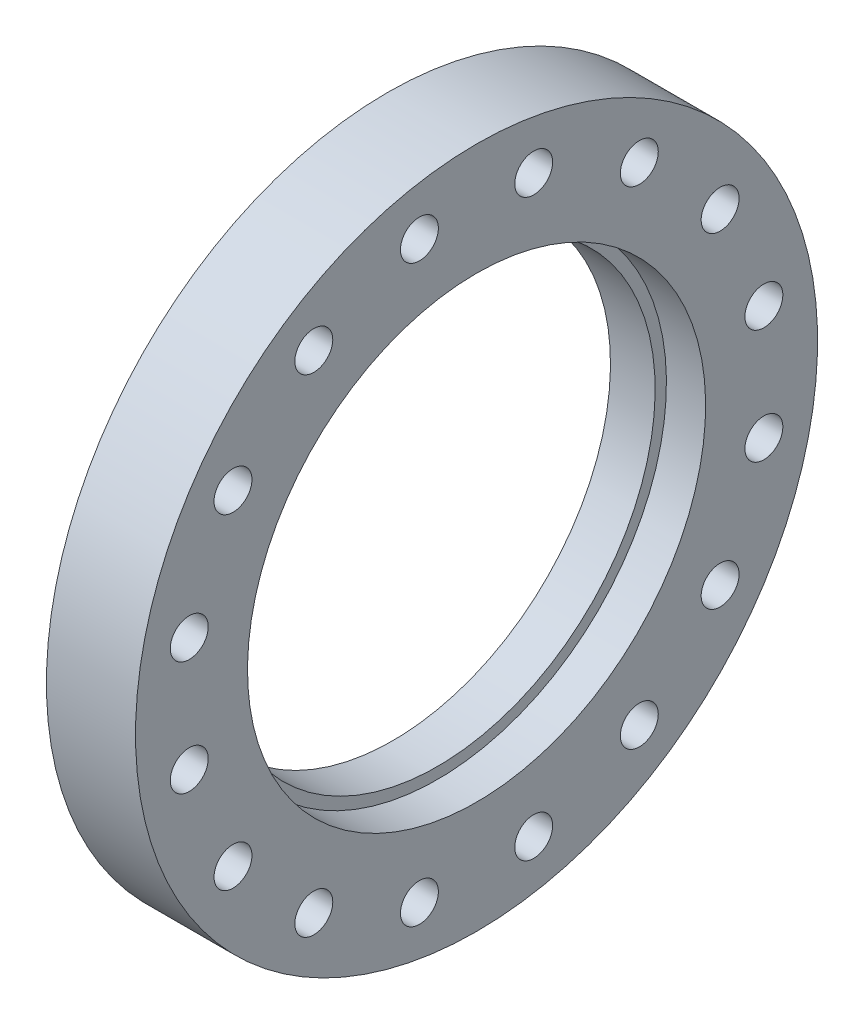
ISO-10303-21;
HEADER;
FILE_DESCRIPTION(('STEP AP214'),'2;1');
FILE_NAME('part.step','',(''),(''),'','','');
FILE_SCHEMA(('AUTOMOTIVE_DESIGN { 1 0 10303 214 1 1 1 1 }'));
ENDSEC;
DATA;
#1=APPLICATION_CONTEXT('core data for automotive mechanical design processes');
#2=APPLICATION_PROTOCOL_DEFINITION('international standard','automotive_design',2000,#1);
#3=PRODUCT_CONTEXT('',#1,'mechanical');
#4=PRODUCT('Part','Part','',(#3));
#5=PRODUCT_RELATED_PRODUCT_CATEGORY('part','',(#4));
#6=PRODUCT_DEFINITION_FORMATION('','',#4);
#7=PRODUCT_DEFINITION_CONTEXT('part definition',#1,'design');
#8=PRODUCT_DEFINITION('design','',#6,#7);
#9=PRODUCT_DEFINITION_SHAPE('','',#8);
#10=(LENGTH_UNIT() NAMED_UNIT(*) SI_UNIT(.MILLI.,.METRE.));
#11=(NAMED_UNIT(*) PLANE_ANGLE_UNIT() SI_UNIT($,.RADIAN.));
#12=(NAMED_UNIT(*) SI_UNIT($,.STERADIAN.) SOLID_ANGLE_UNIT());
#13=UNCERTAINTY_MEASURE_WITH_UNIT(LENGTH_MEASURE(1.E-05),#10,'distance_accuracy_value','');
#14=(GEOMETRIC_REPRESENTATION_CONTEXT(3) GLOBAL_UNCERTAINTY_ASSIGNED_CONTEXT((#13)) GLOBAL_UNIT_ASSIGNED_CONTEXT((#10,
#11,#12)) REPRESENTATION_CONTEXT('',''));
#15=CARTESIAN_POINT('',(0.,0.,0.));
#16=DIRECTION('',(0.,0.,1.));
#17=DIRECTION('',(1.,0.,0.));
#18=AXIS2_PLACEMENT_3D('',#15,#16,#17);
#19=CARTESIAN_POINT('',(1.17000000000035,53.038375,0.));
#20=DIRECTION('',(-1.,0.,0.));
#21=DIRECTION('',(0.,0.,1.));
#22=AXIS2_PLACEMENT_3D('',#19,#20,#21);
#23=PLANE('',#22);
#24=CARTESIAN_POINT('',(1.17000000000036,0.,0.));
#25=DIRECTION('',(1.,0.,0.));
#26=DIRECTION('',(0.,1.,0.));
#27=AXIS2_PLACEMENT_3D('',#24,#25,#26);
#28=CIRCLE('',#27,48.41875);
#29=CARTESIAN_POINT('',(1.17000000000035,48.41875,0.));
#30=VERTEX_POINT('',#29);
#31=EDGE_CURVE('E18',#30,#30,#28,.T.);
#32=ORIENTED_EDGE('',*,*,#31,.T.);
#33=EDGE_LOOP('',(#32));
#34=FACE_BOUND('',#33,.T.);
#35=CARTESIAN_POINT('',(1.17000000000036,0.,0.));
#36=DIRECTION('',(1.,0.,0.));
#37=DIRECTION('',(0.,1.,0.));
#38=AXIS2_PLACEMENT_3D('',#35,#36,#37);
#39=CIRCLE('',#38,57.658);
#40=CARTESIAN_POINT('',(1.17000000000035,57.658,0.));
#41=VERTEX_POINT('',#40);
#42=EDGE_CURVE('E141',#41,#41,#39,.F.);
#43=ORIENTED_EDGE('',*,*,#42,.T.);
#44=EDGE_LOOP('',(#43));
#45=FACE_BOUND('',#44,.T.);
#46=ADVANCED_FACE('F14',(#34,#45),#23,.T.);
#47=CARTESIAN_POINT('',(6.1349000000002,0.,0.));
#48=DIRECTION('',(1.,0.,0.));
#49=DIRECTION('',(0.,1.,0.));
#50=AXIS2_PLACEMENT_3D('',#47,#48,#49);
#51=CYLINDRICAL_SURFACE('',#50,48.41875);
#52=CARTESIAN_POINT('',(11.0998,0.,0.));
#53=DIRECTION('',(1.,0.,0.));
#54=DIRECTION('',(0.,1.,0.));
#55=AXIS2_PLACEMENT_3D('',#52,#53,#54);
#56=CIRCLE('',#55,48.41875);
#57=CARTESIAN_POINT('',(11.0998,48.41875,0.));
#58=VERTEX_POINT('',#57);
#59=EDGE_CURVE('E139',#58,#58,#56,.F.);
#60=ORIENTED_EDGE('',*,*,#59,.F.);
#61=EDGE_LOOP('',(#60));
#62=FACE_BOUND('',#61,.T.);
#63=ORIENTED_EDGE('',*,*,#31,.F.);
#64=EDGE_LOOP('',(#63));
#65=FACE_BOUND('',#64,.T.);
#66=ADVANCED_FACE('F149',(#62,#65),#51,.F.);
#67=CARTESIAN_POINT('',(0.915000000000277,0.,0.));
#68=DIRECTION('',(1.,0.,0.));
#69=DIRECTION('',(0.,1.,0.));
#70=AXIS2_PLACEMENT_3D('',#67,#68,#69);
#71=CYLINDRICAL_SURFACE('',#70,57.658);
#72=ORIENTED_EDGE('',*,*,#42,.F.);
#73=EDGE_LOOP('',(#72));
#74=FACE_BOUND('',#73,.T.);
#75=CARTESIAN_POINT('',(0.659999998138597,0.,0.));
#76=DIRECTION('',(1.,0.,0.));
#77=DIRECTION('',(0.,1.,0.));
#78=AXIS2_PLACEMENT_3D('',#75,#76,#77);
#79=CIRCLE('',#78,57.6580000006776);
#80=CARTESIAN_POINT('',(0.659999998138589,57.6580000006776,0.));
#81=VERTEX_POINT('',#80);
#82=EDGE_CURVE('E138',#81,#81,#79,.T.);
#83=ORIENTED_EDGE('',*,*,#82,.F.);
#84=EDGE_LOOP('',(#83));
#85=FACE_BOUND('',#84,.T.);
#86=ADVANCED_FACE('F151',(#74,#85),#71,.F.);
#87=CARTESIAN_POINT('',(11.0998,49.672875,0.));
#88=DIRECTION('',(1.,0.,0.));
#89=DIRECTION('',(0.,0.,-1.));
#90=AXIS2_PLACEMENT_3D('',#87,#88,#89);
#91=PLANE('',#90);
#92=ORIENTED_EDGE('',*,*,#59,.T.);
#93=EDGE_LOOP('',(#92));
#94=FACE_BOUND('',#93,.T.);
#95=CARTESIAN_POINT('',(11.0998,0.,0.));
#96=DIRECTION('',(1.,0.,0.));
#97=DIRECTION('',(0.,1.,0.));
#98=AXIS2_PLACEMENT_3D('',#95,#96,#97);
#99=CIRCLE('',#98,50.927);
#100=CARTESIAN_POINT('',(11.0998,50.927,0.));
#101=VERTEX_POINT('',#100);
#102=EDGE_CURVE('E135',#101,#101,#99,.T.);
#103=ORIENTED_EDGE('',*,*,#102,.T.);
#104=EDGE_LOOP('',(#103));
#105=FACE_BOUND('',#104,.T.);
#106=ADVANCED_FACE('F159',(#94,#105),#91,.T.);
#107=CARTESIAN_POINT('',(1.63070861664959,0.,0.));
#108=DIRECTION('',(1.,0.,0.));
#109=DIRECTION('',(0.,1.,0.));
#110=AXIS2_PLACEMENT_3D('',#107,#108,#109);
#111=CONICAL_SURFACE('',#110,60.3249999993224,1.22173047500006);
#112=ORIENTED_EDGE('',*,*,#82,.T.);
#113=EDGE_LOOP('',(#112));
#114=FACE_BOUND('',#113,.T.);
#115=CARTESIAN_POINT('',(1.63070861478799,0.,0.));
#116=DIRECTION('',(1.,0.,0.));
#117=DIRECTION('',(0.,1.,0.));
#118=AXIS2_PLACEMENT_3D('',#115,#116,#117);
#119=CIRCLE('',#118,60.3249999999999);
#120=CARTESIAN_POINT('',(1.63070861478798,60.3249999999999,0.));
#121=VERTEX_POINT('',#120);
#122=EDGE_CURVE('E134',#121,#121,#119,.F.);
#123=ORIENTED_EDGE('',*,*,#122,.T.);
#124=EDGE_LOOP('',(#123));
#125=FACE_BOUND('',#124,.T.);
#126=ADVANCED_FACE('F187',(#114,#125),#111,.T.);
#127=CARTESIAN_POINT('',(15.4558999999997,0.,0.));
#128=DIRECTION('',(1.,0.,0.));
#129=DIRECTION('',(0.,1.,0.));
#130=AXIS2_PLACEMENT_3D('',#127,#128,#129);
#131=CYLINDRICAL_SURFACE('',#130,50.927);
#132=CARTESIAN_POINT('',(19.8119999999994,0.,0.));
#133=DIRECTION('',(1.,0.,0.));
#134=DIRECTION('',(0.,1.,0.));
#135=AXIS2_PLACEMENT_3D('',#132,#133,#134);
#136=CIRCLE('',#135,50.927);
#137=CARTESIAN_POINT('',(19.8119999999994,50.927,0.));
#138=VERTEX_POINT('',#137);
#139=EDGE_CURVE('E83',#138,#138,#136,.F.);
#140=ORIENTED_EDGE('',*,*,#139,.F.);
#141=EDGE_LOOP('',(#140));
#142=FACE_BOUND('',#141,.T.);
#143=ORIENTED_EDGE('',*,*,#102,.F.);
#144=EDGE_LOOP('',(#143));
#145=FACE_BOUND('',#144,.T.);
#146=ADVANCED_FACE('F183',(#142,#145),#131,.F.);
#147=CARTESIAN_POINT('',(0.,54.1499573829707,36.1818447675414));
#148=DIRECTION('',(1.,0.,0.));
#149=DIRECTION('',(0.,1.,0.));
#150=AXIS2_PLACEMENT_3D('',#147,#148,#149);
#151=CYLINDRICAL_SURFACE('',#150,4.2164);
#152=CARTESIAN_POINT('',(0.,54.1499573829707,36.1818447675414));
#153=DIRECTION('',(1.,0.,0.));
#154=DIRECTION('',(0.,1.,0.));
#155=AXIS2_PLACEMENT_3D('',#152,#153,#154);
#156=CIRCLE('',#155,4.2164);
#157=CARTESIAN_POINT('',(0.,58.3663573829707,36.1818447675414));
#158=VERTEX_POINT('',#157);
#159=EDGE_CURVE('E80',#158,#158,#156,.T.);
#160=ORIENTED_EDGE('',*,*,#159,.F.);
#161=EDGE_LOOP('',(#160));
#162=FACE_BOUND('',#161,.T.);
#163=CARTESIAN_POINT('',(19.8119999999994,54.1499573829707,36.1818447675414));
#164=DIRECTION('',(1.,0.,0.));
#165=DIRECTION('',(0.,1.,0.));
#166=AXIS2_PLACEMENT_3D('',#163,#164,#165);
#167=CIRCLE('',#166,4.2164);
#168=CARTESIAN_POINT('',(19.8119999999994,58.3663573829707,36.1818447675414));
#169=VERTEX_POINT('',#168);
#170=EDGE_CURVE('E131',#169,#169,#167,.F.);
#171=ORIENTED_EDGE('',*,*,#170,.F.);
#172=EDGE_LOOP('',(#171));
#173=FACE_BOUND('',#172,.T.);
#174=ADVANCED_FACE('F186',(#162,#173),#151,.F.);
#175=CARTESIAN_POINT('',(0.,63.8742298574287,12.7053742754935));
#176=DIRECTION('',(1.,0.,0.));
#177=DIRECTION('',(0.,0.,-1.));
#178=AXIS2_PLACEMENT_3D('',#175,#176,#177);
#179=CYLINDRICAL_SURFACE('',#178,4.21640000000001);
#180=CARTESIAN_POINT('',(0.,63.8742298574287,12.7053742754935));
#181=DIRECTION('',(1.,0.,0.));
#182=DIRECTION('',(0.,0.,-1.));
#183=AXIS2_PLACEMENT_3D('',#180,#181,#182);
#184=CIRCLE('',#183,4.21640000000001);
#185=CARTESIAN_POINT('',(0.,63.8742298574287,8.4889742754935));
#186=VERTEX_POINT('',#185);
#187=EDGE_CURVE('E77',#186,#186,#184,.T.);
#188=ORIENTED_EDGE('',*,*,#187,.F.);
#189=EDGE_LOOP('',(#188));
#190=FACE_BOUND('',#189,.T.);
#191=CARTESIAN_POINT('',(19.8119999999994,63.8742298574287,12.7053742754935));
#192=DIRECTION('',(1.,0.,0.));
#193=DIRECTION('',(0.,0.,-1.));
#194=AXIS2_PLACEMENT_3D('',#191,#192,#193);
#195=CIRCLE('',#194,4.21640000000001);
#196=CARTESIAN_POINT('',(19.8119999999994,63.8742298574287,8.4889742754935));
#197=VERTEX_POINT('',#196);
#198=EDGE_CURVE('E128',#197,#197,#195,.F.);
#199=ORIENTED_EDGE('',*,*,#198,.F.);
#200=EDGE_LOOP('',(#199));
#201=FACE_BOUND('',#200,.T.);
#202=ADVANCED_FACE('F217',(#190,#201),#179,.F.);
#203=CARTESIAN_POINT('',(0.,63.8742298574286,-12.7053742754936));
#204=DIRECTION('',(1.,0.,0.));
#205=DIRECTION('',(0.,0.,-1.));
#206=AXIS2_PLACEMENT_3D('',#203,#204,#205);
#207=CYLINDRICAL_SURFACE('',#206,4.21639999999999);
#208=CARTESIAN_POINT('',(0.,63.8742298574286,-12.7053742754936));
#209=DIRECTION('',(1.,0.,0.));
#210=DIRECTION('',(0.,0.,-1.));
#211=AXIS2_PLACEMENT_3D('',#208,#209,#210);
#212=CIRCLE('',#211,4.21639999999999);
#213=CARTESIAN_POINT('',(0.,63.8742298574286,-16.9217742754936));
#214=VERTEX_POINT('',#213);
#215=EDGE_CURVE('E74',#214,#214,#212,.T.);
#216=ORIENTED_EDGE('',*,*,#215,.F.);
#217=EDGE_LOOP('',(#216));
#218=FACE_BOUND('',#217,.T.);
#219=CARTESIAN_POINT('',(19.8119999999994,63.8742298574286,-12.7053742754936));
#220=DIRECTION('',(1.,0.,0.));
#221=DIRECTION('',(0.,0.,-1.));
#222=AXIS2_PLACEMENT_3D('',#219,#220,#221);
#223=CIRCLE('',#222,4.21639999999999);
#224=CARTESIAN_POINT('',(19.8119999999994,63.8742298574286,-16.9217742754936));
#225=VERTEX_POINT('',#224);
#226=EDGE_CURVE('E125',#225,#225,#223,.F.);
#227=ORIENTED_EDGE('',*,*,#226,.F.);
#228=EDGE_LOOP('',(#227));
#229=FACE_BOUND('',#228,.T.);
#230=ADVANCED_FACE('F225',(#218,#229),#207,.F.);
#231=CARTESIAN_POINT('',(0.,54.1499573829706,-36.1818447675415));
#232=DIRECTION('',(1.,0.,0.));
#233=DIRECTION('',(0.,0.,-1.));
#234=AXIS2_PLACEMENT_3D('',#231,#232,#233);
#235=CYLINDRICAL_SURFACE('',#234,4.21639999999998);
#236=CARTESIAN_POINT('',(0.,54.1499573829706,-36.1818447675415));
#237=DIRECTION('',(1.,0.,0.));
#238=DIRECTION('',(0.,0.,-1.));
#239=AXIS2_PLACEMENT_3D('',#236,#237,#238);
#240=CIRCLE('',#239,4.21639999999998);
#241=CARTESIAN_POINT('',(0.,54.1499573829706,-40.3982447675415));
#242=VERTEX_POINT('',#241);
#243=EDGE_CURVE('E71',#242,#242,#240,.T.);
#244=ORIENTED_EDGE('',*,*,#243,.F.);
#245=EDGE_LOOP('',(#244));
#246=FACE_BOUND('',#245,.T.);
#247=CARTESIAN_POINT('',(19.8119999999994,54.1499573829706,-36.1818447675415));
#248=DIRECTION('',(1.,0.,0.));
#249=DIRECTION('',(0.,0.,-1.));
#250=AXIS2_PLACEMENT_3D('',#247,#248,#249);
#251=CIRCLE('',#250,4.21639999999998);
#252=CARTESIAN_POINT('',(19.8119999999994,54.1499573829706,-40.3982447675415));
#253=VERTEX_POINT('',#252);
#254=EDGE_CURVE('E122',#253,#253,#251,.F.);
#255=ORIENTED_EDGE('',*,*,#254,.F.);
#256=EDGE_LOOP('',(#255));
#257=FACE_BOUND('',#256,.T.);
#258=ADVANCED_FACE('F233',(#246,#257),#235,.F.);
#259=CARTESIAN_POINT('',(0.,36.1818447675414,-54.1499573829707));
#260=DIRECTION('',(1.,0.,0.));
#261=DIRECTION('',(0.,1.,0.));
#262=AXIS2_PLACEMENT_3D('',#259,#260,#261);
#263=CYLINDRICAL_SURFACE('',#262,4.2164);
#264=CARTESIAN_POINT('',(0.,36.1818447675414,-54.1499573829707));
#265=DIRECTION('',(1.,0.,0.));
#266=DIRECTION('',(0.,1.,0.));
#267=AXIS2_PLACEMENT_3D('',#264,#265,#266);
#268=CIRCLE('',#267,4.2164);
#269=CARTESIAN_POINT('',(0.,40.3982447675414,-54.1499573829707));
#270=VERTEX_POINT('',#269);
#271=EDGE_CURVE('E68',#270,#270,#268,.T.);
#272=ORIENTED_EDGE('',*,*,#271,.F.);
#273=EDGE_LOOP('',(#272));
#274=FACE_BOUND('',#273,.T.);
#275=CARTESIAN_POINT('',(19.8119999999994,36.1818447675414,-54.1499573829707));
#276=DIRECTION('',(1.,0.,0.));
#277=DIRECTION('',(0.,1.,0.));
#278=AXIS2_PLACEMENT_3D('',#275,#276,#277);
#279=CIRCLE('',#278,4.2164);
#280=CARTESIAN_POINT('',(19.8119999999994,40.3982447675414,-54.1499573829707));
#281=VERTEX_POINT('',#280);
#282=EDGE_CURVE('E119',#281,#281,#279,.F.);
#283=ORIENTED_EDGE('',*,*,#282,.F.);
#284=EDGE_LOOP('',(#283));
#285=FACE_BOUND('',#284,.T.);
#286=ADVANCED_FACE('F241',(#274,#285),#263,.F.);
#287=CARTESIAN_POINT('',(0.,12.7053742754936,-63.8742298574286));
#288=DIRECTION('',(1.,0.,0.));
#289=DIRECTION('',(0.,1.,0.));
#290=AXIS2_PLACEMENT_3D('',#287,#288,#289);
#291=CYLINDRICAL_SURFACE('',#290,4.21639999999999);
#292=CARTESIAN_POINT('',(0.,12.7053742754936,-63.8742298574286));
#293=DIRECTION('',(1.,0.,0.));
#294=DIRECTION('',(0.,1.,0.));
#295=AXIS2_PLACEMENT_3D('',#292,#293,#294);
#296=CIRCLE('',#295,4.21639999999999);
#297=CARTESIAN_POINT('',(0.,16.9217742754935,-63.8742298574286));
#298=VERTEX_POINT('',#297);
#299=EDGE_CURVE('E65',#298,#298,#296,.T.);
#300=ORIENTED_EDGE('',*,*,#299,.F.);
#301=EDGE_LOOP('',(#300));
#302=FACE_BOUND('',#301,.T.);
#303=CARTESIAN_POINT('',(19.8119999999994,12.7053742754936,-63.8742298574286));
#304=DIRECTION('',(1.,0.,0.));
#305=DIRECTION('',(0.,1.,0.));
#306=AXIS2_PLACEMENT_3D('',#303,#304,#305);
#307=CIRCLE('',#306,4.21639999999999);
#308=CARTESIAN_POINT('',(19.8119999999994,16.9217742754935,-63.8742298574286));
#309=VERTEX_POINT('',#308);
#310=EDGE_CURVE('E116',#309,#309,#307,.F.);
#311=ORIENTED_EDGE('',*,*,#310,.F.);
#312=EDGE_LOOP('',(#311));
#313=FACE_BOUND('',#312,.T.);
#314=ADVANCED_FACE('F249',(#302,#313),#291,.F.);
#315=CARTESIAN_POINT('',(0.,-12.7053742754936,-63.8742298574286));
#316=DIRECTION('',(1.,0.,0.));
#317=DIRECTION('',(0.,1.,0.));
#318=AXIS2_PLACEMENT_3D('',#315,#316,#317);
#319=CYLINDRICAL_SURFACE('',#318,4.21639999999999);
#320=CARTESIAN_POINT('',(0.,-12.7053742754936,-63.8742298574286));
#321=DIRECTION('',(1.,0.,0.));
#322=DIRECTION('',(0.,1.,0.));
#323=AXIS2_PLACEMENT_3D('',#320,#321,#322);
#324=CIRCLE('',#323,4.21639999999999);
#325=CARTESIAN_POINT('',(0.,-8.48897427549359,-63.8742298574286));
#326=VERTEX_POINT('',#325);
#327=EDGE_CURVE('E62',#326,#326,#324,.T.);
#328=ORIENTED_EDGE('',*,*,#327,.F.);
#329=EDGE_LOOP('',(#328));
#330=FACE_BOUND('',#329,.T.);
#331=CARTESIAN_POINT('',(19.8119999999994,-12.7053742754936,-63.8742298574286));
#332=DIRECTION('',(1.,0.,0.));
#333=DIRECTION('',(0.,1.,0.));
#334=AXIS2_PLACEMENT_3D('',#331,#332,#333);
#335=CIRCLE('',#334,4.21639999999999);
#336=CARTESIAN_POINT('',(19.8119999999994,-8.48897427549359,-63.8742298574286));
#337=VERTEX_POINT('',#336);
#338=EDGE_CURVE('E113',#337,#337,#335,.F.);
#339=ORIENTED_EDGE('',*,*,#338,.F.);
#340=EDGE_LOOP('',(#339));
#341=FACE_BOUND('',#340,.T.);
#342=ADVANCED_FACE('F257',(#330,#341),#319,.F.);
#343=CARTESIAN_POINT('',(0.,-36.1818447675414,-54.1499573829706));
#344=DIRECTION('',(1.,0.,0.));
#345=DIRECTION('',(0.,1.,0.));
#346=AXIS2_PLACEMENT_3D('',#343,#344,#345);
#347=CYLINDRICAL_SURFACE('',#346,4.21639999999998);
#348=CARTESIAN_POINT('',(0.,-36.1818447675414,-54.1499573829706));
#349=DIRECTION('',(1.,0.,0.));
#350=DIRECTION('',(0.,1.,0.));
#351=AXIS2_PLACEMENT_3D('',#348,#349,#350);
#352=CIRCLE('',#351,4.21639999999998);
#353=CARTESIAN_POINT('',(0.,-31.9654447675415,-54.1499573829706));
#354=VERTEX_POINT('',#353);
#355=EDGE_CURVE('E59',#354,#354,#352,.T.);
#356=ORIENTED_EDGE('',*,*,#355,.F.);
#357=EDGE_LOOP('',(#356));
#358=FACE_BOUND('',#357,.T.);
#359=CARTESIAN_POINT('',(19.8119999999994,-36.1818447675414,-54.1499573829706));
#360=DIRECTION('',(1.,0.,0.));
#361=DIRECTION('',(0.,1.,0.));
#362=AXIS2_PLACEMENT_3D('',#359,#360,#361);
#363=CIRCLE('',#362,4.21639999999998);
#364=CARTESIAN_POINT('',(19.8119999999994,-31.9654447675415,-54.1499573829706));
#365=VERTEX_POINT('',#364);
#366=EDGE_CURVE('E110',#365,#365,#363,.F.);
#367=ORIENTED_EDGE('',*,*,#366,.F.);
#368=EDGE_LOOP('',(#367));
#369=FACE_BOUND('',#368,.T.);
#370=ADVANCED_FACE('F265',(#358,#369),#347,.F.);
#371=CARTESIAN_POINT('',(0.,-54.1499573829707,-36.1818447675414));
#372=DIRECTION('',(1.,0.,0.));
#373=DIRECTION('',(0.,0.,-1.));
#374=AXIS2_PLACEMENT_3D('',#371,#372,#373);
#375=CYLINDRICAL_SURFACE('',#374,4.2164);
#376=CARTESIAN_POINT('',(0.,-54.1499573829707,-36.1818447675414));
#377=DIRECTION('',(1.,0.,0.));
#378=DIRECTION('',(0.,0.,-1.));
#379=AXIS2_PLACEMENT_3D('',#376,#377,#378);
#380=CIRCLE('',#379,4.2164);
#381=CARTESIAN_POINT('',(0.,-54.1499573829707,-40.3982447675414));
#382=VERTEX_POINT('',#381);
#383=EDGE_CURVE('E56',#382,#382,#380,.T.);
#384=ORIENTED_EDGE('',*,*,#383,.F.);
#385=EDGE_LOOP('',(#384));
#386=FACE_BOUND('',#385,.T.);
#387=CARTESIAN_POINT('',(19.8119999999994,-54.1499573829707,-36.1818447675414));
#388=DIRECTION('',(1.,0.,0.));
#389=DIRECTION('',(0.,0.,-1.));
#390=AXIS2_PLACEMENT_3D('',#387,#388,#389);
#391=CIRCLE('',#390,4.2164);
#392=CARTESIAN_POINT('',(19.8119999999994,-54.1499573829707,-40.3982447675414));
#393=VERTEX_POINT('',#392);
#394=EDGE_CURVE('E107',#393,#393,#391,.F.);
#395=ORIENTED_EDGE('',*,*,#394,.F.);
#396=EDGE_LOOP('',(#395));
#397=FACE_BOUND('',#396,.T.);
#398=ADVANCED_FACE('F273',(#386,#397),#375,.F.);
#399=CARTESIAN_POINT('',(0.,-63.8742298574287,-12.7053742754935));
#400=DIRECTION('',(1.,0.,0.));
#401=DIRECTION('',(0.,0.,-1.));
#402=AXIS2_PLACEMENT_3D('',#399,#400,#401);
#403=CYLINDRICAL_SURFACE('',#402,4.21640000000001);
#404=CARTESIAN_POINT('',(0.,-63.8742298574287,-12.7053742754935));
#405=DIRECTION('',(1.,0.,0.));
#406=DIRECTION('',(0.,0.,-1.));
#407=AXIS2_PLACEMENT_3D('',#404,#405,#406);
#408=CIRCLE('',#407,4.21640000000001);
#409=CARTESIAN_POINT('',(0.,-63.8742298574287,-16.9217742754935));
#410=VERTEX_POINT('',#409);
#411=EDGE_CURVE('E53',#410,#410,#408,.T.);
#412=ORIENTED_EDGE('',*,*,#411,.F.);
#413=EDGE_LOOP('',(#412));
#414=FACE_BOUND('',#413,.T.);
#415=CARTESIAN_POINT('',(19.8119999999994,-63.8742298574287,-12.7053742754935));
#416=DIRECTION('',(1.,0.,0.));
#417=DIRECTION('',(0.,0.,-1.));
#418=AXIS2_PLACEMENT_3D('',#415,#416,#417);
#419=CIRCLE('',#418,4.21640000000001);
#420=CARTESIAN_POINT('',(19.8119999999994,-63.8742298574287,-16.9217742754935));
#421=VERTEX_POINT('',#420);
#422=EDGE_CURVE('E104',#421,#421,#419,.F.);
#423=ORIENTED_EDGE('',*,*,#422,.F.);
#424=EDGE_LOOP('',(#423));
#425=FACE_BOUND('',#424,.T.);
#426=ADVANCED_FACE('F281',(#414,#425),#403,.F.);
#427=CARTESIAN_POINT('',(0.,-63.8742298574286,12.7053742754936));
#428=DIRECTION('',(1.,0.,0.));
#429=DIRECTION('',(0.,0.,-1.));
#430=AXIS2_PLACEMENT_3D('',#427,#428,#429);
#431=CYLINDRICAL_SURFACE('',#430,4.21639999999999);
#432=CARTESIAN_POINT('',(0.,-63.8742298574286,12.7053742754936));
#433=DIRECTION('',(1.,0.,0.));
#434=DIRECTION('',(0.,0.,-1.));
#435=AXIS2_PLACEMENT_3D('',#432,#433,#434);
#436=CIRCLE('',#435,4.21639999999999);
#437=CARTESIAN_POINT('',(0.,-63.8742298574286,8.48897427549362));
#438=VERTEX_POINT('',#437);
#439=EDGE_CURVE('E50',#438,#438,#436,.T.);
#440=ORIENTED_EDGE('',*,*,#439,.F.);
#441=EDGE_LOOP('',(#440));
#442=FACE_BOUND('',#441,.T.);
#443=CARTESIAN_POINT('',(19.8119999999994,-63.8742298574286,12.7053742754936));
#444=DIRECTION('',(1.,0.,0.));
#445=DIRECTION('',(0.,0.,-1.));
#446=AXIS2_PLACEMENT_3D('',#443,#444,#445);
#447=CIRCLE('',#446,4.21639999999999);
#448=CARTESIAN_POINT('',(19.8119999999994,-63.8742298574286,8.48897427549362));
#449=VERTEX_POINT('',#448);
#450=EDGE_CURVE('E101',#449,#449,#447,.F.);
#451=ORIENTED_EDGE('',*,*,#450,.F.);
#452=EDGE_LOOP('',(#451));
#453=FACE_BOUND('',#452,.T.);
#454=ADVANCED_FACE('F289',(#442,#453),#431,.F.);
#455=CARTESIAN_POINT('',(0.,-54.1499573829706,36.1818447675414));
#456=DIRECTION('',(1.,0.,0.));
#457=DIRECTION('',(0.,0.,-1.));
#458=AXIS2_PLACEMENT_3D('',#455,#456,#457);
#459=CYLINDRICAL_SURFACE('',#458,4.21639999999998);
#460=CARTESIAN_POINT('',(0.,-54.1499573829706,36.1818447675414));
#461=DIRECTION('',(1.,0.,0.));
#462=DIRECTION('',(0.,0.,-1.));
#463=AXIS2_PLACEMENT_3D('',#460,#461,#462);
#464=CIRCLE('',#463,4.21639999999998);
#465=CARTESIAN_POINT('',(0.,-54.1499573829706,31.9654447675415));
#466=VERTEX_POINT('',#465);
#467=EDGE_CURVE('E47',#466,#466,#464,.T.);
#468=ORIENTED_EDGE('',*,*,#467,.F.);
#469=EDGE_LOOP('',(#468));
#470=FACE_BOUND('',#469,.T.);
#471=CARTESIAN_POINT('',(19.8119999999994,-54.1499573829706,36.1818447675414));
#472=DIRECTION('',(1.,0.,0.));
#473=DIRECTION('',(0.,0.,-1.));
#474=AXIS2_PLACEMENT_3D('',#471,#472,#473);
#475=CIRCLE('',#474,4.21639999999998);
#476=CARTESIAN_POINT('',(19.8119999999994,-54.1499573829706,31.9654447675415));
#477=VERTEX_POINT('',#476);
#478=EDGE_CURVE('E98',#477,#477,#475,.F.);
#479=ORIENTED_EDGE('',*,*,#478,.F.);
#480=EDGE_LOOP('',(#479));
#481=FACE_BOUND('',#480,.T.);
#482=ADVANCED_FACE('F297',(#470,#481),#459,.F.);
#483=CARTESIAN_POINT('',(0.,-36.1818447675414,54.1499573829707));
#484=DIRECTION('',(1.,0.,0.));
#485=DIRECTION('',(0.,0.,-1.));
#486=AXIS2_PLACEMENT_3D('',#483,#484,#485);
#487=CYLINDRICAL_SURFACE('',#486,4.2164);
#488=CARTESIAN_POINT('',(0.,-36.1818447675414,54.1499573829707));
#489=DIRECTION('',(1.,0.,0.));
#490=DIRECTION('',(0.,0.,-1.));
#491=AXIS2_PLACEMENT_3D('',#488,#489,#490);
#492=CIRCLE('',#491,4.2164);
#493=CARTESIAN_POINT('',(0.,-36.1818447675414,49.9335573829707));
#494=VERTEX_POINT('',#493);
#495=EDGE_CURVE('E44',#494,#494,#492,.T.);
#496=ORIENTED_EDGE('',*,*,#495,.F.);
#497=EDGE_LOOP('',(#496));
#498=FACE_BOUND('',#497,.T.);
#499=CARTESIAN_POINT('',(19.8119999999994,-36.1818447675414,54.1499573829707));
#500=DIRECTION('',(1.,0.,0.));
#501=DIRECTION('',(0.,0.,-1.));
#502=AXIS2_PLACEMENT_3D('',#499,#500,#501);
#503=CIRCLE('',#502,4.2164);
#504=CARTESIAN_POINT('',(19.8119999999994,-36.1818447675414,49.9335573829707));
#505=VERTEX_POINT('',#504);
#506=EDGE_CURVE('E95',#505,#505,#503,.F.);
#507=ORIENTED_EDGE('',*,*,#506,.F.);
#508=EDGE_LOOP('',(#507));
#509=FACE_BOUND('',#508,.T.);
#510=ADVANCED_FACE('F305',(#498,#509),#487,.F.);
#511=CARTESIAN_POINT('',(0.,-12.7053742754935,63.8742298574286));
#512=DIRECTION('',(1.,0.,0.));
#513=DIRECTION('',(0.,1.,0.));
#514=AXIS2_PLACEMENT_3D('',#511,#512,#513);
#515=CYLINDRICAL_SURFACE('',#514,4.21639999999999);
#516=CARTESIAN_POINT('',(0.,-12.7053742754935,63.8742298574286));
#517=DIRECTION('',(1.,0.,0.));
#518=DIRECTION('',(0.,1.,0.));
#519=AXIS2_PLACEMENT_3D('',#516,#517,#518);
#520=CIRCLE('',#519,4.21639999999999);
#521=CARTESIAN_POINT('',(0.,-8.48897427549355,63.8742298574286));
#522=VERTEX_POINT('',#521);
#523=EDGE_CURVE('E41',#522,#522,#520,.T.);
#524=ORIENTED_EDGE('',*,*,#523,.F.);
#525=EDGE_LOOP('',(#524));
#526=FACE_BOUND('',#525,.T.);
#527=CARTESIAN_POINT('',(19.8119999999994,-12.7053742754935,63.8742298574286));
#528=DIRECTION('',(1.,0.,0.));
#529=DIRECTION('',(0.,1.,0.));
#530=AXIS2_PLACEMENT_3D('',#527,#528,#529);
#531=CIRCLE('',#530,4.21639999999999);
#532=CARTESIAN_POINT('',(19.8119999999994,-8.48897427549355,63.8742298574286));
#533=VERTEX_POINT('',#532);
#534=EDGE_CURVE('E92',#533,#533,#531,.F.);
#535=ORIENTED_EDGE('',*,*,#534,.F.);
#536=EDGE_LOOP('',(#535));
#537=FACE_BOUND('',#536,.T.);
#538=ADVANCED_FACE('F313',(#526,#537),#515,.F.);
#539=CARTESIAN_POINT('',(0.,36.1818447675415,54.1499573829706));
#540=DIRECTION('',(1.,0.,0.));
#541=DIRECTION('',(0.,1.,0.));
#542=AXIS2_PLACEMENT_3D('',#539,#540,#541);
#543=CYLINDRICAL_SURFACE('',#542,4.21639999999999);
#544=CARTESIAN_POINT('',(0.,36.1818447675415,54.1499573829706));
#545=DIRECTION('',(1.,0.,0.));
#546=DIRECTION('',(0.,1.,0.));
#547=AXIS2_PLACEMENT_3D('',#544,#545,#546);
#548=CIRCLE('',#547,4.21639999999999);
#549=CARTESIAN_POINT('',(0.,40.3982447675415,54.1499573829706));
#550=VERTEX_POINT('',#549);
#551=EDGE_CURVE('E38',#550,#550,#548,.T.);
#552=ORIENTED_EDGE('',*,*,#551,.F.);
#553=EDGE_LOOP('',(#552));
#554=FACE_BOUND('',#553,.T.);
#555=CARTESIAN_POINT('',(19.8119999999994,36.1818447675415,54.1499573829706));
#556=DIRECTION('',(1.,0.,0.));
#557=DIRECTION('',(0.,1.,0.));
#558=AXIS2_PLACEMENT_3D('',#555,#556,#557);
#559=CIRCLE('',#558,4.21639999999999);
#560=CARTESIAN_POINT('',(19.8119999999994,40.3982447675415,54.1499573829706));
#561=VERTEX_POINT('',#560);
#562=EDGE_CURVE('E89',#561,#561,#559,.F.);
#563=ORIENTED_EDGE('',*,*,#562,.F.);
#564=EDGE_LOOP('',(#563));
#565=FACE_BOUND('',#564,.T.);
#566=ADVANCED_FACE('F321',(#554,#565),#543,.F.);
#567=CARTESIAN_POINT('',(0.,12.7053742754936,63.8742298574286));
#568=DIRECTION('',(1.,0.,0.));
#569=DIRECTION('',(0.,1.,0.));
#570=AXIS2_PLACEMENT_3D('',#567,#568,#569);
#571=CYLINDRICAL_SURFACE('',#570,4.21639999999999);
#572=CARTESIAN_POINT('',(0.,12.7053742754936,63.8742298574286));
#573=DIRECTION('',(1.,0.,0.));
#574=DIRECTION('',(0.,1.,0.));
#575=AXIS2_PLACEMENT_3D('',#572,#573,#574);
#576=CIRCLE('',#575,4.21639999999999);
#577=CARTESIAN_POINT('',(0.,16.9217742754936,63.8742298574286));
#578=VERTEX_POINT('',#577);
#579=EDGE_CURVE('E35',#578,#578,#576,.T.);
#580=ORIENTED_EDGE('',*,*,#579,.F.);
#581=EDGE_LOOP('',(#580));
#582=FACE_BOUND('',#581,.T.);
#583=CARTESIAN_POINT('',(19.8119999999994,12.7053742754936,63.8742298574286));
#584=DIRECTION('',(1.,0.,0.));
#585=DIRECTION('',(0.,1.,0.));
#586=AXIS2_PLACEMENT_3D('',#583,#584,#585);
#587=CIRCLE('',#586,4.21639999999999);
#588=CARTESIAN_POINT('',(19.8119999999994,16.9217742754936,63.8742298574286));
#589=VERTEX_POINT('',#588);
#590=EDGE_CURVE('E86',#589,#589,#587,.F.);
#591=ORIENTED_EDGE('',*,*,#590,.F.);
#592=EDGE_LOOP('',(#591));
#593=FACE_BOUND('',#592,.T.);
#594=ADVANCED_FACE('F16',(#582,#593),#571,.F.);
#595=CARTESIAN_POINT('',(0.815354307394017,0.,0.));
#596=DIRECTION('',(1.,0.,0.));
#597=DIRECTION('',(0.,1.,0.));
#598=AXIS2_PLACEMENT_3D('',#595,#596,#597);
#599=CYLINDRICAL_SURFACE('',#598,60.3249999999999);
#600=ORIENTED_EDGE('',*,*,#122,.F.);
#601=EDGE_LOOP('',(#600));
#602=FACE_BOUND('',#601,.T.);
#603=CARTESIAN_POINT('',(0.,0.,0.));
#604=DIRECTION('',(1.,0.,0.));
#605=DIRECTION('',(0.,1.,0.));
#606=AXIS2_PLACEMENT_3D('',#603,#604,#605);
#607=CIRCLE('',#606,60.3249999999999);
#608=CARTESIAN_POINT('',(0.,60.3249999999999,0.));
#609=VERTEX_POINT('',#608);
#610=EDGE_CURVE('E27',#609,#609,#607,.T.);
#611=ORIENTED_EDGE('',*,*,#610,.F.);
#612=EDGE_LOOP('',(#611));
#613=FACE_BOUND('',#612,.T.);
#614=ADVANCED_FACE('F178',(#602,#613),#599,.F.);
#615=CARTESIAN_POINT('',(19.8119999999994,63.3729999999994,0.));
#616=DIRECTION('',(1.,0.,0.));
#617=DIRECTION('',(0.,0.,-1.));
#618=AXIS2_PLACEMENT_3D('',#615,#616,#617);
#619=PLANE('',#618);
#620=ORIENTED_EDGE('',*,*,#139,.T.);
#621=EDGE_LOOP('',(#620));
#622=FACE_BOUND('',#621,.T.);
#623=ORIENTED_EDGE('',*,*,#590,.T.);
#624=EDGE_LOOP('',(#623));
#625=FACE_BOUND('',#624,.T.);
#626=ORIENTED_EDGE('',*,*,#562,.T.);
#627=EDGE_LOOP('',(#626));
#628=FACE_BOUND('',#627,.T.);
#629=ORIENTED_EDGE('',*,*,#534,.T.);
#630=EDGE_LOOP('',(#629));
#631=FACE_BOUND('',#630,.T.);
#632=ORIENTED_EDGE('',*,*,#506,.T.);
#633=EDGE_LOOP('',(#632));
#634=FACE_BOUND('',#633,.T.);
#635=ORIENTED_EDGE('',*,*,#478,.T.);
#636=EDGE_LOOP('',(#635));
#637=FACE_BOUND('',#636,.T.);
#638=ORIENTED_EDGE('',*,*,#450,.T.);
#639=EDGE_LOOP('',(#638));
#640=FACE_BOUND('',#639,.T.);
#641=ORIENTED_EDGE('',*,*,#422,.T.);
#642=EDGE_LOOP('',(#641));
#643=FACE_BOUND('',#642,.T.);
#644=ORIENTED_EDGE('',*,*,#394,.T.);
#645=EDGE_LOOP('',(#644));
#646=FACE_BOUND('',#645,.T.);
#647=ORIENTED_EDGE('',*,*,#366,.T.);
#648=EDGE_LOOP('',(#647));
#649=FACE_BOUND('',#648,.T.);
#650=ORIENTED_EDGE('',*,*,#338,.T.);
#651=EDGE_LOOP('',(#650));
#652=FACE_BOUND('',#651,.T.);
#653=ORIENTED_EDGE('',*,*,#310,.T.);
#654=EDGE_LOOP('',(#653));
#655=FACE_BOUND('',#654,.T.);
#656=ORIENTED_EDGE('',*,*,#282,.T.);
#657=EDGE_LOOP('',(#656));
#658=FACE_BOUND('',#657,.T.);
#659=ORIENTED_EDGE('',*,*,#254,.T.);
#660=EDGE_LOOP('',(#659));
#661=FACE_BOUND('',#660,.T.);
#662=ORIENTED_EDGE('',*,*,#226,.T.);
#663=EDGE_LOOP('',(#662));
#664=FACE_BOUND('',#663,.T.);
#665=ORIENTED_EDGE('',*,*,#198,.T.);
#666=EDGE_LOOP('',(#665));
#667=FACE_BOUND('',#666,.T.);
#668=ORIENTED_EDGE('',*,*,#170,.T.);
#669=EDGE_LOOP('',(#668));
#670=FACE_BOUND('',#669,.T.);
#671=CARTESIAN_POINT('',(19.8119999999994,0.,0.));
#672=DIRECTION('',(1.,0.,0.));
#673=DIRECTION('',(0.,1.,0.));
#674=AXIS2_PLACEMENT_3D('',#671,#672,#673);
#675=CIRCLE('',#674,75.8189999999988);
#676=CARTESIAN_POINT('',(19.8119999999994,75.8189999999988,0.));
#677=VERTEX_POINT('',#676);
#678=EDGE_CURVE('E22',#677,#677,#675,.F.);
#679=ORIENTED_EDGE('',*,*,#678,.F.);
#680=EDGE_LOOP('',(#679));
#681=FACE_BOUND('',#680,.T.);
#682=ADVANCED_FACE('F171',(#622,#625,#628,#631,#634,#637,#640,#643,#646,#649,#652,#655,#658,
#661,#664,#667,#670,#681),#619,.T.);
#683=CARTESIAN_POINT('',(0.,68.0719999999993,0.));
#684=DIRECTION('',(-1.,0.,0.));
#685=DIRECTION('',(0.,0.,1.));
#686=AXIS2_PLACEMENT_3D('',#683,#684,#685);
#687=PLANE('',#686);
#688=ORIENTED_EDGE('',*,*,#610,.T.);
#689=EDGE_LOOP('',(#688));
#690=FACE_BOUND('',#689,.T.);
#691=ORIENTED_EDGE('',*,*,#579,.T.);
#692=EDGE_LOOP('',(#691));
#693=FACE_BOUND('',#692,.T.);
#694=ORIENTED_EDGE('',*,*,#551,.T.);
#695=EDGE_LOOP('',(#694));
#696=FACE_BOUND('',#695,.T.);
#697=ORIENTED_EDGE('',*,*,#523,.T.);
#698=EDGE_LOOP('',(#697));
#699=FACE_BOUND('',#698,.T.);
#700=ORIENTED_EDGE('',*,*,#495,.T.);
#701=EDGE_LOOP('',(#700));
#702=FACE_BOUND('',#701,.T.);
#703=ORIENTED_EDGE('',*,*,#467,.T.);
#704=EDGE_LOOP('',(#703));
#705=FACE_BOUND('',#704,.T.);
#706=ORIENTED_EDGE('',*,*,#439,.T.);
#707=EDGE_LOOP('',(#706));
#708=FACE_BOUND('',#707,.T.);
#709=ORIENTED_EDGE('',*,*,#411,.T.);
#710=EDGE_LOOP('',(#709));
#711=FACE_BOUND('',#710,.T.);
#712=ORIENTED_EDGE('',*,*,#383,.T.);
#713=EDGE_LOOP('',(#712));
#714=FACE_BOUND('',#713,.T.);
#715=ORIENTED_EDGE('',*,*,#355,.T.);
#716=EDGE_LOOP('',(#715));
#717=FACE_BOUND('',#716,.T.);
#718=ORIENTED_EDGE('',*,*,#327,.T.);
#719=EDGE_LOOP('',(#718));
#720=FACE_BOUND('',#719,.T.);
#721=ORIENTED_EDGE('',*,*,#299,.T.);
#722=EDGE_LOOP('',(#721));
#723=FACE_BOUND('',#722,.T.);
#724=ORIENTED_EDGE('',*,*,#271,.T.);
#725=EDGE_LOOP('',(#724));
#726=FACE_BOUND('',#725,.T.);
#727=ORIENTED_EDGE('',*,*,#243,.T.);
#728=EDGE_LOOP('',(#727));
#729=FACE_BOUND('',#728,.T.);
#730=ORIENTED_EDGE('',*,*,#215,.T.);
#731=EDGE_LOOP('',(#730));
#732=FACE_BOUND('',#731,.T.);
#733=ORIENTED_EDGE('',*,*,#187,.T.);
#734=EDGE_LOOP('',(#733));
#735=FACE_BOUND('',#734,.T.);
#736=ORIENTED_EDGE('',*,*,#159,.T.);
#737=EDGE_LOOP('',(#736));
#738=FACE_BOUND('',#737,.T.);
#739=CARTESIAN_POINT('',(0.,0.,0.));
#740=DIRECTION('',(1.,0.,0.));
#741=DIRECTION('',(0.,1.,0.));
#742=AXIS2_PLACEMENT_3D('',#739,#740,#741);
#743=CIRCLE('',#742,75.8189999999988);
#744=CARTESIAN_POINT('',(0.,75.8189999999988,0.));
#745=VERTEX_POINT('',#744);
#746=EDGE_CURVE('E10',#745,#745,#743,.T.);
#747=ORIENTED_EDGE('',*,*,#746,.F.);
#748=EDGE_LOOP('',(#747));
#749=FACE_BOUND('',#748,.T.);
#750=ADVANCED_FACE('F166',(#690,#693,#696,#699,#702,#705,#708,#711,#714,#717,#720,#723,#726,
#729,#732,#735,#738,#749),#687,.T.);
#751=CARTESIAN_POINT('',(9.90599999999975,0.,0.));
#752=DIRECTION('',(1.,0.,0.));
#753=DIRECTION('',(0.,1.,0.));
#754=AXIS2_PLACEMENT_3D('',#751,#752,#753);
#755=CYLINDRICAL_SURFACE('',#754,75.8189999999988);
#756=ORIENTED_EDGE('',*,*,#746,.T.);
#757=EDGE_LOOP('',(#756));
#758=FACE_BOUND('',#757,.T.);
#759=ORIENTED_EDGE('',*,*,#678,.T.);
#760=EDGE_LOOP('',(#759));
#761=FACE_BOUND('',#760,.T.);
#762=ADVANCED_FACE('F164',(#758,#761),#755,.T.);
#763=CLOSED_SHELL('',(#46,#66,#86,#106,#126,#146,#174,#202,#230,#258,#286,#314,#342,#370,#398,
#426,#454,#482,#510,#538,#566,#594,#614,#682,#750,#762));
#764=MANIFOLD_SOLID_BREP('B1',#763);
#765=ADVANCED_BREP_SHAPE_REPRESENTATION('',(#18,#764),#14);
#766=SHAPE_DEFINITION_REPRESENTATION(#9,#765);
ENDSEC;
END-ISO-10303-21;
